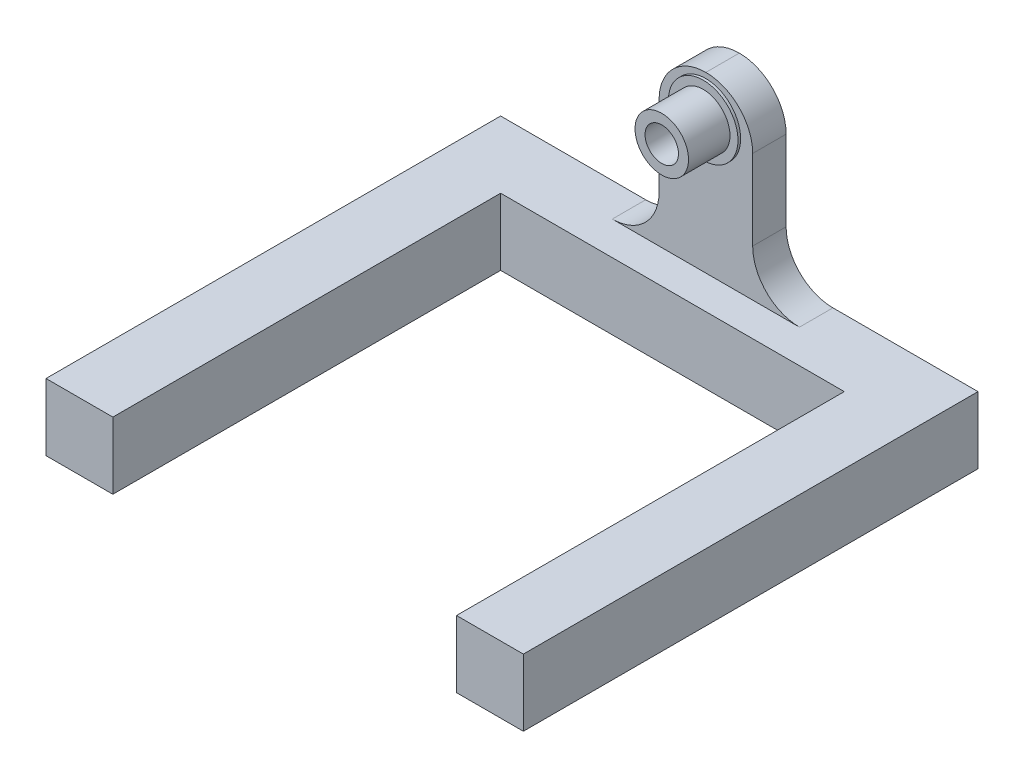
ISO-10303-21;
HEADER;
FILE_DESCRIPTION(('STEP AP214'),'2;1');
FILE_NAME('part.step','',(''),(''),'','','');
FILE_SCHEMA(('AUTOMOTIVE_DESIGN { 1 0 10303 214 1 1 1 1 }'));
ENDSEC;
DATA;
#1=APPLICATION_CONTEXT('core data for automotive mechanical design processes');
#2=APPLICATION_PROTOCOL_DEFINITION('international standard','automotive_design',2000,#1);
#3=PRODUCT_CONTEXT('',#1,'mechanical');
#4=PRODUCT('Part','Part','',(#3));
#5=PRODUCT_RELATED_PRODUCT_CATEGORY('part','',(#4));
#6=PRODUCT_DEFINITION_FORMATION('','',#4);
#7=PRODUCT_DEFINITION_CONTEXT('part definition',#1,'design');
#8=PRODUCT_DEFINITION('design','',#6,#7);
#9=PRODUCT_DEFINITION_SHAPE('','',#8);
#10=(LENGTH_UNIT() NAMED_UNIT(*) SI_UNIT(.MILLI.,.METRE.));
#11=(NAMED_UNIT(*) PLANE_ANGLE_UNIT() SI_UNIT($,.RADIAN.));
#12=(NAMED_UNIT(*) SI_UNIT($,.STERADIAN.) SOLID_ANGLE_UNIT());
#13=UNCERTAINTY_MEASURE_WITH_UNIT(LENGTH_MEASURE(1.E-05),#10,'distance_accuracy_value','');
#14=(GEOMETRIC_REPRESENTATION_CONTEXT(3) GLOBAL_UNCERTAINTY_ASSIGNED_CONTEXT((#13)) GLOBAL_UNIT_ASSIGNED_CONTEXT((#10,
#11,#12)) REPRESENTATION_CONTEXT('',''));
#15=CARTESIAN_POINT('',(0.,0.,0.));
#16=DIRECTION('',(0.,0.,1.));
#17=DIRECTION('',(1.,0.,0.));
#18=AXIS2_PLACEMENT_3D('',#15,#16,#17);
#19=CARTESIAN_POINT('',(-35.7,10.,-46.5));
#20=DIRECTION('',(0.,0.,1.));
#21=DIRECTION('',(1.,0.,0.));
#22=AXIS2_PLACEMENT_3D('',#19,#20,#21);
#23=PLANE('',#22);
#24=CARTESIAN_POINT('',(0.,29.,-46.5));
#25=DIRECTION('',(0.,0.,1.));
#26=DIRECTION('',(1.,0.,0.));
#27=AXIS2_PLACEMENT_3D('',#24,#25,#26);
#28=CIRCLE('',#27,7.);
#29=CARTESIAN_POINT('',(-7.00000000000001,29.,-46.5));
#30=VERTEX_POINT('',#29);
#31=CARTESIAN_POINT('',(0.,36.,-46.5));
#32=VERTEX_POINT('',#31);
#33=EDGE_CURVE('E69',#30,#32,#28,.F.);
#34=ORIENTED_EDGE('',*,*,#33,.T.);
#35=CARTESIAN_POINT('',(0.,29.,-46.5));
#36=DIRECTION('',(0.,0.,1.));
#37=DIRECTION('',(1.,0.,0.));
#38=AXIS2_PLACEMENT_3D('',#35,#36,#37);
#39=CIRCLE('',#38,7.);
#40=CARTESIAN_POINT('',(6.99999999999999,29.,-46.5));
#41=VERTEX_POINT('',#40);
#42=EDGE_CURVE('E217',#32,#41,#39,.F.);
#43=ORIENTED_EDGE('',*,*,#42,.T.);
#44=DIRECTION('',(0.,-1.,0.));
#45=VECTOR('',#44,1.);
#46=CARTESIAN_POINT('',(6.99999999999999,36.,-46.5));
#47=LINE('',#46,#45);
#48=CARTESIAN_POINT('',(6.99999999999999,17.,-46.5));
#49=VERTEX_POINT('',#48);
#50=EDGE_CURVE('E240',#41,#49,#47,.T.);
#51=ORIENTED_EDGE('',*,*,#50,.T.);
#52=CARTESIAN_POINT('',(14.,17.,-46.5));
#53=DIRECTION('',(0.,0.,1.));
#54=DIRECTION('',(1.,0.,0.));
#55=AXIS2_PLACEMENT_3D('',#52,#53,#54);
#56=CIRCLE('',#55,7.);
#57=CARTESIAN_POINT('',(14.,10.,-46.5));
#58=VERTEX_POINT('',#57);
#59=EDGE_CURVE('E222',#49,#58,#56,.T.);
#60=ORIENTED_EDGE('',*,*,#59,.T.);
#61=DIRECTION('',(-1.,0.,0.));
#62=VECTOR('',#61,1.);
#63=CARTESIAN_POINT('',(-35.7,10.,-46.5));
#64=LINE('',#63,#62);
#65=CARTESIAN_POINT('',(35.7,10.,-46.5));
#66=VERTEX_POINT('',#65);
#67=EDGE_CURVE('E191',#66,#58,#64,.T.);
#68=ORIENTED_EDGE('',*,*,#67,.F.);
#69=DIRECTION('',(0.,-1.,0.));
#70=VECTOR('',#69,1.);
#71=CARTESIAN_POINT('',(35.7,10.,-46.5));
#72=LINE('',#71,#70);
#73=CARTESIAN_POINT('',(35.7,0.,-46.5));
#74=VERTEX_POINT('',#73);
#75=EDGE_CURVE('E190',#66,#74,#72,.T.);
#76=ORIENTED_EDGE('',*,*,#75,.T.);
#77=DIRECTION('',(-1.,0.,0.));
#78=VECTOR('',#77,1.);
#79=CARTESIAN_POINT('',(-35.7,0.,-46.5));
#80=LINE('',#79,#78);
#81=CARTESIAN_POINT('',(-35.7,0.,-46.5));
#82=VERTEX_POINT('',#81);
#83=EDGE_CURVE('E177',#74,#82,#80,.T.);
#84=ORIENTED_EDGE('',*,*,#83,.T.);
#85=DIRECTION('',(0.,-1.,0.));
#86=VECTOR('',#85,1.);
#87=CARTESIAN_POINT('',(-35.7,10.,-46.5));
#88=LINE('',#87,#86);
#89=CARTESIAN_POINT('',(-35.7,10.,-46.5));
#90=VERTEX_POINT('',#89);
#91=EDGE_CURVE('E187',#90,#82,#88,.T.);
#92=ORIENTED_EDGE('',*,*,#91,.F.);
#93=CARTESIAN_POINT('',(-14.,10.,-46.5));
#94=VERTEX_POINT('',#93);
#95=EDGE_CURVE('E231',#94,#90,#64,.T.);
#96=ORIENTED_EDGE('',*,*,#95,.F.);
#97=CARTESIAN_POINT('',(-14.,17.,-46.5));
#98=DIRECTION('',(0.,0.,1.));
#99=DIRECTION('',(1.,0.,0.));
#100=AXIS2_PLACEMENT_3D('',#97,#98,#99);
#101=CIRCLE('',#100,7.);
#102=CARTESIAN_POINT('',(-7.00000000000001,17.,-46.5));
#103=VERTEX_POINT('',#102);
#104=EDGE_CURVE('E54',#94,#103,#101,.T.);
#105=ORIENTED_EDGE('',*,*,#104,.T.);
#106=DIRECTION('',(0.,1.,0.));
#107=VECTOR('',#106,1.);
#108=CARTESIAN_POINT('',(-7.,10.,-46.5));
#109=LINE('',#108,#107);
#110=EDGE_CURVE('E229',#103,#30,#109,.T.);
#111=ORIENTED_EDGE('',*,*,#110,.T.);
#112=EDGE_LOOP('',(#34,#43,#51,#60,#68,#76,#84,#92,#96,#105,#111));
#113=FACE_BOUND('',#112,.T.);
#114=CARTESIAN_POINT('',(0.,30.,-46.5));
#115=DIRECTION('',(0.,0.,1.));
#116=DIRECTION('',(1.,0.,0.));
#117=AXIS2_PLACEMENT_3D('',#114,#115,#116);
#118=CIRCLE('',#117,2.9);
#119=CARTESIAN_POINT('',(2.89999999999999,30.,-46.5));
#120=VERTEX_POINT('',#119);
#121=EDGE_CURVE('E197',#120,#120,#118,.F.);
#122=ORIENTED_EDGE('',*,*,#121,.F.);
#123=EDGE_LOOP('',(#122));
#124=FACE_BOUND('',#123,.T.);
#125=ADVANCED_FACE('F45',(#113,#124),#23,.F.);
#126=CARTESIAN_POINT('',(0.,0.,-41.5));
#127=DIRECTION('',(0.,0.,-1.));
#128=DIRECTION('',(-1.,0.,0.));
#129=AXIS2_PLACEMENT_3D('',#126,#127,#128);
#130=PLANE('',#129);
#131=DIRECTION('',(0.,-1.,0.));
#132=VECTOR('',#131,1.);
#133=CARTESIAN_POINT('',(6.99999999999999,36.,-41.5));
#134=LINE('',#133,#132);
#135=CARTESIAN_POINT('',(6.99999999999999,29.,-41.5));
#136=VERTEX_POINT('',#135);
#137=CARTESIAN_POINT('',(6.99999999999999,17.,-41.5));
#138=VERTEX_POINT('',#137);
#139=EDGE_CURVE('E249',#136,#138,#134,.T.);
#140=ORIENTED_EDGE('',*,*,#139,.F.);
#141=CARTESIAN_POINT('',(0.,29.,-41.5));
#142=DIRECTION('',(0.,0.,-1.));
#143=DIRECTION('',(-1.,0.,0.));
#144=AXIS2_PLACEMENT_3D('',#141,#142,#143);
#145=CIRCLE('',#144,7.);
#146=CARTESIAN_POINT('',(0.,36.,-41.5));
#147=VERTEX_POINT('',#146);
#148=EDGE_CURVE('E61',#136,#147,#145,.F.);
#149=ORIENTED_EDGE('',*,*,#148,.T.);
#150=CARTESIAN_POINT('',(0.,29.,-41.5));
#151=DIRECTION('',(0.,0.,-1.));
#152=DIRECTION('',(-1.,0.,0.));
#153=AXIS2_PLACEMENT_3D('',#150,#151,#152);
#154=CIRCLE('',#153,7.);
#155=CARTESIAN_POINT('',(-7.00000000000001,29.,-41.5));
#156=VERTEX_POINT('',#155);
#157=EDGE_CURVE('E219',#147,#156,#154,.F.);
#158=ORIENTED_EDGE('',*,*,#157,.T.);
#159=DIRECTION('',(0.,1.,0.));
#160=VECTOR('',#159,1.);
#161=CARTESIAN_POINT('',(-7.,10.,-41.5));
#162=LINE('',#161,#160);
#163=CARTESIAN_POINT('',(-7.,17.,-41.5));
#164=VERTEX_POINT('',#163);
#165=EDGE_CURVE('E248',#164,#156,#162,.T.);
#166=ORIENTED_EDGE('',*,*,#165,.F.);
#167=CARTESIAN_POINT('',(-14.,17.,-41.5));
#168=DIRECTION('',(0.,0.,-1.));
#169=DIRECTION('',(-1.,0.,0.));
#170=AXIS2_PLACEMENT_3D('',#167,#168,#169);
#171=CIRCLE('',#170,7.);
#172=CARTESIAN_POINT('',(-14.,10.,-41.5));
#173=VERTEX_POINT('',#172);
#174=EDGE_CURVE('E11',#164,#173,#171,.T.);
#175=ORIENTED_EDGE('',*,*,#174,.T.);
#176=DIRECTION('',(-1.,0.,0.));
#177=VECTOR('',#176,1.);
#178=CARTESIAN_POINT('',(-7.,10.,-41.5));
#179=LINE('',#178,#177);
#180=CARTESIAN_POINT('',(14.,10.,-41.5));
#181=VERTEX_POINT('',#180);
#182=EDGE_CURVE('E247',#181,#173,#179,.T.);
#183=ORIENTED_EDGE('',*,*,#182,.F.);
#184=CARTESIAN_POINT('',(14.,17.,-41.5));
#185=DIRECTION('',(0.,0.,-1.));
#186=DIRECTION('',(-1.,0.,0.));
#187=AXIS2_PLACEMENT_3D('',#184,#185,#186);
#188=CIRCLE('',#187,7.);
#189=EDGE_CURVE('E224',#181,#138,#188,.T.);
#190=ORIENTED_EDGE('',*,*,#189,.T.);
#191=EDGE_LOOP('',(#140,#149,#158,#166,#175,#183,#190));
#192=FACE_BOUND('',#191,.T.);
#193=CARTESIAN_POINT('',(0.,30.,-41.5));
#194=DIRECTION('',(0.,0.,-1.));
#195=DIRECTION('',(-1.,0.,0.));
#196=AXIS2_PLACEMENT_3D('',#193,#194,#195);
#197=CIRCLE('',#196,5.2);
#198=CARTESIAN_POINT('',(-5.20000000000001,30.,-41.5));
#199=VERTEX_POINT('',#198);
#200=EDGE_CURVE('E193',#199,#199,#197,.F.);
#201=ORIENTED_EDGE('',*,*,#200,.F.);
#202=EDGE_LOOP('',(#201));
#203=FACE_BOUND('',#202,.T.);
#204=ADVANCED_FACE('F245',(#192,#203),#130,.F.);
#205=CARTESIAN_POINT('',(0.,10.,0.));
#206=DIRECTION('',(0.,1.,0.));
#207=DIRECTION('',(0.,0.,1.));
#208=AXIS2_PLACEMENT_3D('',#205,#206,#207);
#209=PLANE('',#208);
#210=ORIENTED_EDGE('',*,*,#67,.T.);
#211=DIRECTION('',(0.,0.,-1.));
#212=VECTOR('',#211,1.);
#213=CARTESIAN_POINT('',(14.,10.,-41.5));
#214=LINE('',#213,#212);
#215=EDGE_CURVE('E209',#58,#181,#214,.F.);
#216=ORIENTED_EDGE('',*,*,#215,.T.);
#217=ORIENTED_EDGE('',*,*,#182,.T.);
#218=DIRECTION('',(0.,0.,-1.));
#219=VECTOR('',#218,1.);
#220=CARTESIAN_POINT('',(-14.,10.,-46.5));
#221=LINE('',#220,#219);
#222=EDGE_CURVE('E206',#173,#94,#221,.T.);
#223=ORIENTED_EDGE('',*,*,#222,.T.);
#224=ORIENTED_EDGE('',*,*,#95,.T.);
#225=DIRECTION('',(0.,0.,1.));
#226=VECTOR('',#225,1.);
#227=CARTESIAN_POINT('',(-35.7,10.,-46.5));
#228=LINE('',#227,#226);
#229=CARTESIAN_POINT('',(-35.7,10.,21.5));
#230=VERTEX_POINT('',#229);
#231=EDGE_CURVE('E180',#90,#230,#228,.T.);
#232=ORIENTED_EDGE('',*,*,#231,.T.);
#233=DIRECTION('',(-1.,0.,0.));
#234=VECTOR('',#233,1.);
#235=CARTESIAN_POINT('',(-35.7,10.,21.5));
#236=LINE('',#235,#234);
#237=CARTESIAN_POINT('',(-25.7,10.,21.5));
#238=VERTEX_POINT('',#237);
#239=EDGE_CURVE('E603',#238,#230,#236,.T.);
#240=ORIENTED_EDGE('',*,*,#239,.F.);
#241=DIRECTION('',(0.,0.,1.));
#242=VECTOR('',#241,1.);
#243=CARTESIAN_POINT('',(-25.7,10.,-36.5));
#244=LINE('',#243,#242);
#245=CARTESIAN_POINT('',(-25.7,10.,-36.5));
#246=VERTEX_POINT('',#245);
#247=EDGE_CURVE('E259',#246,#238,#244,.T.);
#248=ORIENTED_EDGE('',*,*,#247,.F.);
#249=DIRECTION('',(-1.,0.,0.));
#250=VECTOR('',#249,1.);
#251=CARTESIAN_POINT('',(-25.7,10.,-36.5));
#252=LINE('',#251,#250);
#253=CARTESIAN_POINT('',(25.7,10.,-36.5));
#254=VERTEX_POINT('',#253);
#255=EDGE_CURVE('E265',#254,#246,#252,.T.);
#256=ORIENTED_EDGE('',*,*,#255,.F.);
#257=DIRECTION('',(0.,0.,-1.));
#258=VECTOR('',#257,1.);
#259=CARTESIAN_POINT('',(25.7,10.,-36.5));
#260=LINE('',#259,#258);
#261=CARTESIAN_POINT('',(25.7,10.,21.5));
#262=VERTEX_POINT('',#261);
#263=EDGE_CURVE('E262',#262,#254,#260,.T.);
#264=ORIENTED_EDGE('',*,*,#263,.F.);
#265=CARTESIAN_POINT('',(35.7,10.,21.5));
#266=VERTEX_POINT('',#265);
#267=EDGE_CURVE('E297',#266,#262,#236,.T.);
#268=ORIENTED_EDGE('',*,*,#267,.F.);
#269=DIRECTION('',(0.,0.,-1.));
#270=VECTOR('',#269,1.);
#271=CARTESIAN_POINT('',(35.7,10.,-46.5));
#272=LINE('',#271,#270);
#273=EDGE_CURVE('E171',#266,#66,#272,.T.);
#274=ORIENTED_EDGE('',*,*,#273,.T.);
#275=EDGE_LOOP('',(#210,#216,#217,#223,#224,#232,#240,#248,#256,#264,#268,#274));
#276=FACE_BOUND('',#275,.T.);
#277=ADVANCED_FACE('F284',(#276),#209,.T.);
#278=CARTESIAN_POINT('',(0.,0.,0.));
#279=DIRECTION('',(0.,1.,0.));
#280=DIRECTION('',(0.,0.,1.));
#281=AXIS2_PLACEMENT_3D('',#278,#279,#280);
#282=PLANE('',#281);
#283=DIRECTION('',(0.,0.,-1.));
#284=VECTOR('',#283,1.);
#285=CARTESIAN_POINT('',(35.7,0.,-46.5));
#286=LINE('',#285,#284);
#287=CARTESIAN_POINT('',(35.7,0.,21.5));
#288=VERTEX_POINT('',#287);
#289=EDGE_CURVE('E169',#288,#74,#286,.T.);
#290=ORIENTED_EDGE('',*,*,#289,.F.);
#291=DIRECTION('',(-1.,0.,0.));
#292=VECTOR('',#291,1.);
#293=CARTESIAN_POINT('',(-35.7,0.,21.5));
#294=LINE('',#293,#292);
#295=CARTESIAN_POINT('',(25.7,0.,21.5));
#296=VERTEX_POINT('',#295);
#297=EDGE_CURVE('E153',#288,#296,#294,.T.);
#298=ORIENTED_EDGE('',*,*,#297,.T.);
#299=DIRECTION('',(0.,0.,-1.));
#300=VECTOR('',#299,1.);
#301=CARTESIAN_POINT('',(25.7,0.,-36.5));
#302=LINE('',#301,#300);
#303=CARTESIAN_POINT('',(25.7,0.,-36.5));
#304=VERTEX_POINT('',#303);
#305=EDGE_CURVE('E270',#296,#304,#302,.T.);
#306=ORIENTED_EDGE('',*,*,#305,.T.);
#307=DIRECTION('',(-1.,0.,0.));
#308=VECTOR('',#307,1.);
#309=CARTESIAN_POINT('',(-25.7,0.,-36.5));
#310=LINE('',#309,#308);
#311=CARTESIAN_POINT('',(-25.7,0.,-36.5));
#312=VERTEX_POINT('',#311);
#313=EDGE_CURVE('E263',#304,#312,#310,.T.);
#314=ORIENTED_EDGE('',*,*,#313,.T.);
#315=DIRECTION('',(0.,0.,1.));
#316=VECTOR('',#315,1.);
#317=CARTESIAN_POINT('',(-25.7,0.,-36.5));
#318=LINE('',#317,#316);
#319=CARTESIAN_POINT('',(-25.7,0.,21.5));
#320=VERTEX_POINT('',#319);
#321=EDGE_CURVE('E252',#312,#320,#318,.T.);
#322=ORIENTED_EDGE('',*,*,#321,.T.);
#323=CARTESIAN_POINT('',(-35.7,0.,21.5));
#324=VERTEX_POINT('',#323);
#325=EDGE_CURVE('E163',#320,#324,#294,.T.);
#326=ORIENTED_EDGE('',*,*,#325,.T.);
#327=DIRECTION('',(0.,0.,1.));
#328=VECTOR('',#327,1.);
#329=CARTESIAN_POINT('',(-35.7,0.,-46.5));
#330=LINE('',#329,#328);
#331=EDGE_CURVE('E178',#82,#324,#330,.T.);
#332=ORIENTED_EDGE('',*,*,#331,.F.);
#333=ORIENTED_EDGE('',*,*,#83,.F.);
#334=EDGE_LOOP('',(#290,#298,#306,#314,#322,#326,#332,#333));
#335=FACE_BOUND('',#334,.T.);
#336=ADVANCED_FACE('F175',(#335),#282,.F.);
#337=CARTESIAN_POINT('',(-35.7,10.,-46.5));
#338=DIRECTION('',(1.,0.,0.));
#339=DIRECTION('',(0.,0.,-1.));
#340=AXIS2_PLACEMENT_3D('',#337,#338,#339);
#341=PLANE('',#340);
#342=ORIENTED_EDGE('',*,*,#331,.T.);
#343=DIRECTION('',(0.,1.,0.));
#344=VECTOR('',#343,1.);
#345=CARTESIAN_POINT('',(-35.7,0.,21.5));
#346=LINE('',#345,#344);
#347=EDGE_CURVE('E172',#324,#230,#346,.T.);
#348=ORIENTED_EDGE('',*,*,#347,.T.);
#349=ORIENTED_EDGE('',*,*,#231,.F.);
#350=ORIENTED_EDGE('',*,*,#91,.T.);
#351=EDGE_LOOP('',(#342,#348,#349,#350));
#352=FACE_BOUND('',#351,.T.);
#353=ADVANCED_FACE('F289',(#352),#341,.F.);
#354=CARTESIAN_POINT('',(35.7,10.,-46.5));
#355=DIRECTION('',(-1.,0.,0.));
#356=DIRECTION('',(0.,0.,1.));
#357=AXIS2_PLACEMENT_3D('',#354,#355,#356);
#358=PLANE('',#357);
#359=ORIENTED_EDGE('',*,*,#273,.F.);
#360=DIRECTION('',(0.,1.,0.));
#361=VECTOR('',#360,1.);
#362=CARTESIAN_POINT('',(35.7,0.,21.5));
#363=LINE('',#362,#361);
#364=EDGE_CURVE('E156',#288,#266,#363,.T.);
#365=ORIENTED_EDGE('',*,*,#364,.F.);
#366=ORIENTED_EDGE('',*,*,#289,.T.);
#367=ORIENTED_EDGE('',*,*,#75,.F.);
#368=EDGE_LOOP('',(#359,#365,#366,#367));
#369=FACE_BOUND('',#368,.T.);
#370=ADVANCED_FACE('F167',(#369),#358,.F.);
#371=CARTESIAN_POINT('',(-25.7,10.,-36.5));
#372=DIRECTION('',(1.,0.,0.));
#373=DIRECTION('',(0.,0.,-1.));
#374=AXIS2_PLACEMENT_3D('',#371,#372,#373);
#375=PLANE('',#374);
#376=DIRECTION('',(0.,1.,0.));
#377=VECTOR('',#376,1.);
#378=CARTESIAN_POINT('',(-25.7,10.,21.5));
#379=LINE('',#378,#377);
#380=EDGE_CURVE('E292',#320,#238,#379,.T.);
#381=ORIENTED_EDGE('',*,*,#380,.F.);
#382=ORIENTED_EDGE('',*,*,#321,.F.);
#383=DIRECTION('',(0.,-1.,0.));
#384=VECTOR('',#383,1.);
#385=CARTESIAN_POINT('',(-25.7,10.,-36.5));
#386=LINE('',#385,#384);
#387=EDGE_CURVE('E267',#246,#312,#386,.T.);
#388=ORIENTED_EDGE('',*,*,#387,.F.);
#389=ORIENTED_EDGE('',*,*,#247,.T.);
#390=EDGE_LOOP('',(#381,#382,#388,#389));
#391=FACE_BOUND('',#390,.T.);
#392=ADVANCED_FACE('F338',(#391),#375,.T.);
#393=CARTESIAN_POINT('',(25.7,10.,-36.5));
#394=DIRECTION('',(-1.,0.,0.));
#395=DIRECTION('',(0.,0.,1.));
#396=AXIS2_PLACEMENT_3D('',#393,#394,#395);
#397=PLANE('',#396);
#398=DIRECTION('',(0.,-1.,0.));
#399=VECTOR('',#398,1.);
#400=CARTESIAN_POINT('',(25.7,10.,21.5));
#401=LINE('',#400,#399);
#402=EDGE_CURVE('E159',#262,#296,#401,.T.);
#403=ORIENTED_EDGE('',*,*,#402,.F.);
#404=ORIENTED_EDGE('',*,*,#263,.T.);
#405=DIRECTION('',(0.,-1.,0.));
#406=VECTOR('',#405,1.);
#407=CARTESIAN_POINT('',(25.7,10.,-36.5));
#408=LINE('',#407,#406);
#409=EDGE_CURVE('E183',#254,#304,#408,.T.);
#410=ORIENTED_EDGE('',*,*,#409,.T.);
#411=ORIENTED_EDGE('',*,*,#305,.F.);
#412=EDGE_LOOP('',(#403,#404,#410,#411));
#413=FACE_BOUND('',#412,.T.);
#414=ADVANCED_FACE('F370',(#413),#397,.T.);
#415=CARTESIAN_POINT('',(-25.7,10.,-36.5));
#416=DIRECTION('',(0.,0.,1.));
#417=DIRECTION('',(1.,0.,0.));
#418=AXIS2_PLACEMENT_3D('',#415,#416,#417);
#419=PLANE('',#418);
#420=ORIENTED_EDGE('',*,*,#313,.F.);
#421=ORIENTED_EDGE('',*,*,#409,.F.);
#422=ORIENTED_EDGE('',*,*,#255,.T.);
#423=ORIENTED_EDGE('',*,*,#387,.T.);
#424=EDGE_LOOP('',(#420,#421,#422,#423));
#425=FACE_BOUND('',#424,.T.);
#426=ADVANCED_FACE('F363',(#425),#419,.T.);
#427=CARTESIAN_POINT('',(6.99999999999999,36.,-41.5));
#428=DIRECTION('',(1.,0.,0.));
#429=DIRECTION('',(0.,0.,-1.));
#430=AXIS2_PLACEMENT_3D('',#427,#428,#429);
#431=PLANE('',#430);
#432=ORIENTED_EDGE('',*,*,#139,.T.);
#433=DIRECTION('',(0.,0.,-1.));
#434=VECTOR('',#433,1.);
#435=CARTESIAN_POINT('',(6.99999999999999,17.,-46.5));
#436=LINE('',#435,#434);
#437=EDGE_CURVE('E203',#138,#49,#436,.T.);
#438=ORIENTED_EDGE('',*,*,#437,.T.);
#439=ORIENTED_EDGE('',*,*,#50,.F.);
#440=DIRECTION('',(0.,0.,-1.));
#441=VECTOR('',#440,1.);
#442=CARTESIAN_POINT('',(6.99999999999999,29.,-41.5));
#443=LINE('',#442,#441);
#444=EDGE_CURVE('E200',#41,#136,#443,.F.);
#445=ORIENTED_EDGE('',*,*,#444,.T.);
#446=EDGE_LOOP('',(#432,#438,#439,#445));
#447=FACE_BOUND('',#446,.T.);
#448=ADVANCED_FACE('F359',(#447),#431,.T.);
#449=CARTESIAN_POINT('',(-7.,10.,-41.5));
#450=DIRECTION('',(-1.,0.,0.));
#451=DIRECTION('',(0.,0.,1.));
#452=AXIS2_PLACEMENT_3D('',#449,#450,#451);
#453=PLANE('',#452);
#454=ORIENTED_EDGE('',*,*,#110,.F.);
#455=DIRECTION('',(0.,0.,-1.));
#456=VECTOR('',#455,1.);
#457=CARTESIAN_POINT('',(-7.,17.,-41.5));
#458=LINE('',#457,#456);
#459=EDGE_CURVE('E214',#103,#164,#458,.F.);
#460=ORIENTED_EDGE('',*,*,#459,.T.);
#461=ORIENTED_EDGE('',*,*,#165,.T.);
#462=DIRECTION('',(0.,0.,-1.));
#463=VECTOR('',#462,1.);
#464=CARTESIAN_POINT('',(-7.00000000000001,29.,-41.5));
#465=LINE('',#464,#463);
#466=EDGE_CURVE('E212',#156,#30,#465,.T.);
#467=ORIENTED_EDGE('',*,*,#466,.T.);
#468=EDGE_LOOP('',(#454,#460,#461,#467));
#469=FACE_BOUND('',#468,.T.);
#470=ADVANCED_FACE('F236',(#469),#453,.T.);
#471=CARTESIAN_POINT('',(0.,30.,-41.5));
#472=DIRECTION('',(0.,0.,-1.));
#473=DIRECTION('',(-1.,0.,0.));
#474=AXIS2_PLACEMENT_3D('',#471,#472,#473);
#475=CYLINDRICAL_SURFACE('',#474,2.5);
#476=CARTESIAN_POINT('',(0.,30.,-34.9));
#477=DIRECTION('',(0.,0.,1.));
#478=DIRECTION('',(1.,0.,0.));
#479=AXIS2_PLACEMENT_3D('',#476,#477,#478);
#480=CIRCLE('',#479,2.5);
#481=CARTESIAN_POINT('',(2.49999999999999,30.,-34.9));
#482=VERTEX_POINT('',#481);
#483=EDGE_CURVE('E304',#482,#482,#480,.T.);
#484=ORIENTED_EDGE('',*,*,#483,.T.);
#485=EDGE_LOOP('',(#484));
#486=FACE_BOUND('',#485,.T.);
#487=CARTESIAN_POINT('',(0.,30.,-46.9));
#488=DIRECTION('',(0.,0.,-1.));
#489=DIRECTION('',(-1.,0.,0.));
#490=AXIS2_PLACEMENT_3D('',#487,#488,#489);
#491=CIRCLE('',#490,2.5);
#492=CARTESIAN_POINT('',(-2.50000000000001,30.,-46.9));
#493=VERTEX_POINT('',#492);
#494=EDGE_CURVE('E598',#493,#493,#491,.T.);
#495=ORIENTED_EDGE('',*,*,#494,.T.);
#496=EDGE_LOOP('',(#495));
#497=FACE_BOUND('',#496,.T.);
#498=ADVANCED_FACE('F324',(#486,#497),#475,.F.);
#499=CARTESIAN_POINT('',(0.,30.,-34.9));
#500=DIRECTION('',(0.,0.,1.));
#501=DIRECTION('',(1.,0.,0.));
#502=AXIS2_PLACEMENT_3D('',#499,#500,#501);
#503=PLANE('',#502);
#504=CARTESIAN_POINT('',(0.,30.,-34.9));
#505=DIRECTION('',(0.,0.,1.));
#506=DIRECTION('',(1.,0.,0.));
#507=AXIS2_PLACEMENT_3D('',#504,#505,#506);
#508=CIRCLE('',#507,4.);
#509=CARTESIAN_POINT('',(3.99999999999999,30.,-34.9));
#510=VERTEX_POINT('',#509);
#511=EDGE_CURVE('E241',#510,#510,#508,.T.);
#512=ORIENTED_EDGE('',*,*,#511,.T.);
#513=EDGE_LOOP('',(#512));
#514=FACE_BOUND('',#513,.T.);
#515=ORIENTED_EDGE('',*,*,#483,.F.);
#516=EDGE_LOOP('',(#515));
#517=FACE_BOUND('',#516,.T.);
#518=ADVANCED_FACE('F309',(#514,#517),#503,.T.);
#519=CARTESIAN_POINT('',(0.,30.,-34.9));
#520=DIRECTION('',(0.,0.,-1.));
#521=DIRECTION('',(-1.,0.,0.));
#522=AXIS2_PLACEMENT_3D('',#519,#520,#521);
#523=CYLINDRICAL_SURFACE('',#522,4.);
#524=CARTESIAN_POINT('',(0.,30.,-41.1));
#525=DIRECTION('',(0.,0.,1.));
#526=DIRECTION('',(1.,0.,0.));
#527=AXIS2_PLACEMENT_3D('',#524,#525,#526);
#528=CIRCLE('',#527,4.);
#529=CARTESIAN_POINT('',(3.99999999999999,30.,-41.1));
#530=VERTEX_POINT('',#529);
#531=EDGE_CURVE('E294',#530,#530,#528,.T.);
#532=ORIENTED_EDGE('',*,*,#531,.T.);
#533=EDGE_LOOP('',(#532));
#534=FACE_BOUND('',#533,.T.);
#535=ORIENTED_EDGE('',*,*,#511,.F.);
#536=EDGE_LOOP('',(#535));
#537=FACE_BOUND('',#536,.T.);
#538=ADVANCED_FACE('F312',(#534,#537),#523,.T.);
#539=CARTESIAN_POINT('',(0.,30.,-41.1));
#540=DIRECTION('',(0.,0.,1.));
#541=DIRECTION('',(1.,0.,0.));
#542=AXIS2_PLACEMENT_3D('',#539,#540,#541);
#543=PLANE('',#542);
#544=CARTESIAN_POINT('',(0.,30.,-41.1));
#545=DIRECTION('',(0.,0.,1.));
#546=DIRECTION('',(1.,0.,0.));
#547=AXIS2_PLACEMENT_3D('',#544,#545,#546);
#548=CIRCLE('',#547,5.2);
#549=CARTESIAN_POINT('',(5.19999999999999,30.,-41.1));
#550=VERTEX_POINT('',#549);
#551=EDGE_CURVE('E301',#550,#550,#548,.T.);
#552=ORIENTED_EDGE('',*,*,#551,.T.);
#553=EDGE_LOOP('',(#552));
#554=FACE_BOUND('',#553,.T.);
#555=ORIENTED_EDGE('',*,*,#531,.F.);
#556=EDGE_LOOP('',(#555));
#557=FACE_BOUND('',#556,.T.);
#558=ADVANCED_FACE('F314',(#554,#557),#543,.T.);
#559=CARTESIAN_POINT('',(0.,30.,-41.1));
#560=DIRECTION('',(0.,0.,-1.));
#561=DIRECTION('',(-1.,0.,0.));
#562=AXIS2_PLACEMENT_3D('',#559,#560,#561);
#563=CYLINDRICAL_SURFACE('',#562,5.2);
#564=ORIENTED_EDGE('',*,*,#551,.F.);
#565=EDGE_LOOP('',(#564));
#566=FACE_BOUND('',#565,.T.);
#567=ORIENTED_EDGE('',*,*,#200,.T.);
#568=EDGE_LOOP('',(#567));
#569=FACE_BOUND('',#568,.T.);
#570=ADVANCED_FACE('F321',(#566,#569),#563,.T.);
#571=CARTESIAN_POINT('',(-35.7,0.,21.5));
#572=DIRECTION('',(0.,0.,-1.));
#573=DIRECTION('',(-1.,0.,0.));
#574=AXIS2_PLACEMENT_3D('',#571,#572,#573);
#575=PLANE('',#574);
#576=ORIENTED_EDGE('',*,*,#402,.T.);
#577=ORIENTED_EDGE('',*,*,#297,.F.);
#578=ORIENTED_EDGE('',*,*,#364,.T.);
#579=ORIENTED_EDGE('',*,*,#267,.T.);
#580=EDGE_LOOP('',(#576,#577,#578,#579));
#581=FACE_BOUND('',#580,.T.);
#582=ADVANCED_FACE('F155',(#581),#575,.F.);
#583=ORIENTED_EDGE('',*,*,#380,.T.);
#584=ORIENTED_EDGE('',*,*,#239,.T.);
#585=ORIENTED_EDGE('',*,*,#347,.F.);
#586=ORIENTED_EDGE('',*,*,#325,.F.);
#587=EDGE_LOOP('',(#583,#584,#585,#586));
#588=FACE_BOUND('',#587,.T.);
#589=ADVANCED_FACE('F449',(#588),#575,.F.);
#590=CARTESIAN_POINT('',(0.,30.,-46.9));
#591=DIRECTION('',(0.,0.,-1.));
#592=DIRECTION('',(-1.,0.,0.));
#593=AXIS2_PLACEMENT_3D('',#590,#591,#592);
#594=PLANE('',#593);
#595=CARTESIAN_POINT('',(0.,30.,-46.9));
#596=DIRECTION('',(0.,0.,-1.));
#597=DIRECTION('',(-1.,0.,0.));
#598=AXIS2_PLACEMENT_3D('',#595,#596,#597);
#599=CIRCLE('',#598,2.9);
#600=CARTESIAN_POINT('',(-2.90000000000001,30.,-46.9));
#601=VERTEX_POINT('',#600);
#602=EDGE_CURVE('E600',#601,#601,#599,.T.);
#603=ORIENTED_EDGE('',*,*,#602,.T.);
#604=EDGE_LOOP('',(#603));
#605=FACE_BOUND('',#604,.T.);
#606=ORIENTED_EDGE('',*,*,#494,.F.);
#607=EDGE_LOOP('',(#606));
#608=FACE_BOUND('',#607,.T.);
#609=ADVANCED_FACE('F455',(#605,#608),#594,.T.);
#610=CARTESIAN_POINT('',(0.,30.,-46.9));
#611=DIRECTION('',(0.,0.,1.));
#612=DIRECTION('',(1.,0.,0.));
#613=AXIS2_PLACEMENT_3D('',#610,#611,#612);
#614=CYLINDRICAL_SURFACE('',#613,2.9);
#615=ORIENTED_EDGE('',*,*,#602,.F.);
#616=EDGE_LOOP('',(#615));
#617=FACE_BOUND('',#616,.T.);
#618=ORIENTED_EDGE('',*,*,#121,.T.);
#619=EDGE_LOOP('',(#618));
#620=FACE_BOUND('',#619,.T.);
#621=ADVANCED_FACE('F344',(#617,#620),#614,.T.);
#622=CARTESIAN_POINT('',(14.,17.,-41.5));
#623=DIRECTION('',(0.,0.,1.));
#624=DIRECTION('',(1.,0.,0.));
#625=AXIS2_PLACEMENT_3D('',#622,#623,#624);
#626=CYLINDRICAL_SURFACE('',#625,7.);
#627=ORIENTED_EDGE('',*,*,#189,.F.);
#628=ORIENTED_EDGE('',*,*,#215,.F.);
#629=ORIENTED_EDGE('',*,*,#59,.F.);
#630=ORIENTED_EDGE('',*,*,#437,.F.);
#631=EDGE_LOOP('',(#627,#628,#629,#630));
#632=FACE_BOUND('',#631,.T.);
#633=ADVANCED_FACE('F341',(#632),#626,.F.);
#634=CARTESIAN_POINT('',(-14.,17.,0.));
#635=DIRECTION('',(0.,0.,1.));
#636=DIRECTION('',(1.,0.,0.));
#637=AXIS2_PLACEMENT_3D('',#634,#635,#636);
#638=CYLINDRICAL_SURFACE('',#637,7.);
#639=ORIENTED_EDGE('',*,*,#174,.F.);
#640=ORIENTED_EDGE('',*,*,#459,.F.);
#641=ORIENTED_EDGE('',*,*,#104,.F.);
#642=ORIENTED_EDGE('',*,*,#222,.F.);
#643=EDGE_LOOP('',(#639,#640,#641,#642));
#644=FACE_BOUND('',#643,.T.);
#645=ADVANCED_FACE('F244',(#644),#638,.F.);
#646=CARTESIAN_POINT('',(0.,29.,-41.5));
#647=DIRECTION('',(0.,0.,-1.));
#648=DIRECTION('',(-1.,0.,0.));
#649=AXIS2_PLACEMENT_3D('',#646,#647,#648);
#650=CYLINDRICAL_SURFACE('',#649,7.);
#651=ORIENTED_EDGE('',*,*,#466,.F.);
#652=ORIENTED_EDGE('',*,*,#157,.F.);
#653=DIRECTION('',(0.,0.,-1.));
#654=VECTOR('',#653,1.);
#655=CARTESIAN_POINT('',(0.,36.,-41.5));
#656=LINE('',#655,#654);
#657=EDGE_CURVE('E49',#32,#147,#656,.F.);
#658=ORIENTED_EDGE('',*,*,#657,.F.);
#659=ORIENTED_EDGE('',*,*,#33,.F.);
#660=EDGE_LOOP('',(#651,#652,#658,#659));
#661=FACE_BOUND('',#660,.T.);
#662=ADVANCED_FACE('F47',(#661),#650,.T.);
#663=CARTESIAN_POINT('',(0.,29.,-41.5));
#664=DIRECTION('',(0.,0.,-1.));
#665=DIRECTION('',(-1.,0.,0.));
#666=AXIS2_PLACEMENT_3D('',#663,#664,#665);
#667=CYLINDRICAL_SURFACE('',#666,7.);
#668=ORIENTED_EDGE('',*,*,#148,.F.);
#669=ORIENTED_EDGE('',*,*,#444,.F.);
#670=ORIENTED_EDGE('',*,*,#42,.F.);
#671=ORIENTED_EDGE('',*,*,#657,.T.);
#672=EDGE_LOOP('',(#668,#669,#670,#671));
#673=FACE_BOUND('',#672,.T.);
#674=ADVANCED_FACE('F347',(#673),#667,.T.);
#675=CLOSED_SHELL('',(#125,#204,#277,#336,#353,#370,#392,#414,#426,#448,#470,#498,#518,#538,
#558,#570,#582,#589,#609,#621,#633,#645,#662,#674));
#676=MANIFOLD_SOLID_BREP('B2',#675);
#677=ADVANCED_BREP_SHAPE_REPRESENTATION('',(#18,#676),#14);
#678=SHAPE_DEFINITION_REPRESENTATION(#9,#677);
ENDSEC;
END-ISO-10303-21;
